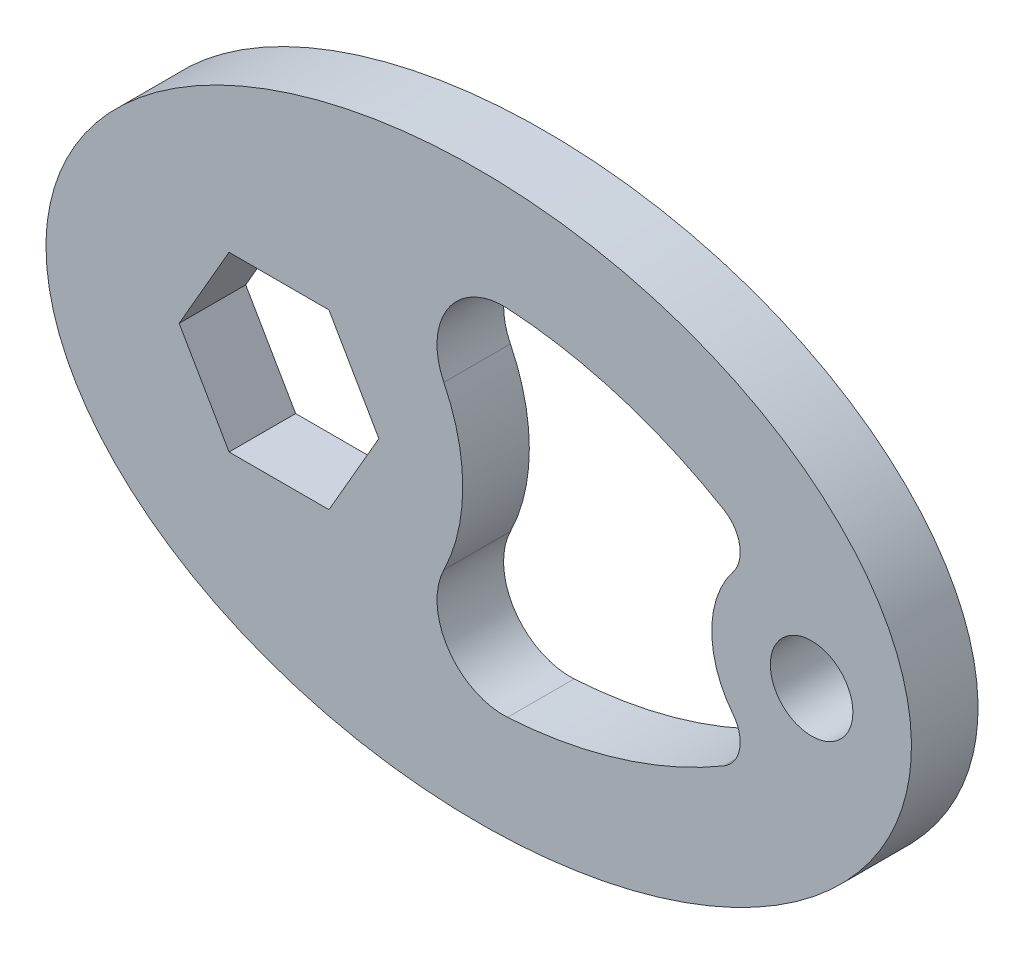
ISO-10303-21;
HEADER;
FILE_DESCRIPTION(('STEP AP214'),'2;1');
FILE_NAME('part.step','',(''),(''),'','','');
FILE_SCHEMA(('AUTOMOTIVE_DESIGN { 1 0 10303 214 1 1 1 1 }'));
ENDSEC;
DATA;
#1=APPLICATION_CONTEXT('core data for automotive mechanical design processes');
#2=APPLICATION_PROTOCOL_DEFINITION('international standard','automotive_design',2000,#1);
#3=PRODUCT_CONTEXT('',#1,'mechanical');
#4=PRODUCT('Part','Part','',(#3));
#5=PRODUCT_RELATED_PRODUCT_CATEGORY('part','',(#4));
#6=PRODUCT_DEFINITION_FORMATION('','',#4);
#7=PRODUCT_DEFINITION_CONTEXT('part definition',#1,'design');
#8=PRODUCT_DEFINITION('design','',#6,#7);
#9=PRODUCT_DEFINITION_SHAPE('','',#8);
#10=(LENGTH_UNIT() NAMED_UNIT(*) SI_UNIT(.MILLI.,.METRE.));
#11=(NAMED_UNIT(*) PLANE_ANGLE_UNIT() SI_UNIT($,.RADIAN.));
#12=(NAMED_UNIT(*) SI_UNIT($,.STERADIAN.) SOLID_ANGLE_UNIT());
#13=UNCERTAINTY_MEASURE_WITH_UNIT(LENGTH_MEASURE(1.E-05),#10,'distance_accuracy_value','');
#14=(GEOMETRIC_REPRESENTATION_CONTEXT(3) GLOBAL_UNCERTAINTY_ASSIGNED_CONTEXT((#13)) GLOBAL_UNIT_ASSIGNED_CONTEXT((#10,
#11,#12)) REPRESENTATION_CONTEXT('',''));
#15=CARTESIAN_POINT('',(0.,0.,0.));
#16=DIRECTION('',(0.,0.,1.));
#17=DIRECTION('',(1.,0.,0.));
#18=AXIS2_PLACEMENT_3D('',#15,#16,#17);
#19=CARTESIAN_POINT('',(0.,0.,0.5));
#20=DIRECTION('',(0.,0.,1.));
#21=DIRECTION('',(1.,0.,0.));
#22=AXIS2_PLACEMENT_3D('',#19,#20,#21);
#23=PLANE('',#22);
#24=CARTESIAN_POINT('',(0.,0.,0.5));
#25=DIRECTION('',(0.,0.,1.));
#26=DIRECTION('',(-1.,0.,0.));
#27=AXIS2_PLACEMENT_3D('',#24,#25,#26);
#28=ELLIPSE('',#27,3.25,2.125);
#29=CARTESIAN_POINT('',(-3.25,0.,0.5));
#30=VERTEX_POINT('',#29);
#31=EDGE_CURVE('E11',#30,#30,#28,.T.);
#32=ORIENTED_EDGE('',*,*,#31,.T.);
#33=EDGE_LOOP('',(#32));
#34=FACE_BOUND('',#33,.T.);
#35=CARTESIAN_POINT('',(2.5,0.,0.5));
#36=DIRECTION('',(0.,0.,1.));
#37=DIRECTION('',(1.,0.,0.));
#38=AXIS2_PLACEMENT_3D('',#35,#36,#37);
#39=CIRCLE('',#38,0.31);
#40=CARTESIAN_POINT('',(2.81,0.,0.5));
#41=VERTEX_POINT('',#40);
#42=EDGE_CURVE('E293',#41,#41,#39,.T.);
#43=ORIENTED_EDGE('',*,*,#42,.F.);
#44=EDGE_LOOP('',(#43));
#45=FACE_BOUND('',#44,.T.);
#46=CARTESIAN_POINT('',(-1.5,0.,0.5));
#47=DIRECTION('',(0.,0.,-1.));
#48=DIRECTION('',(1.,0.,0.));
#49=AXIS2_PLACEMENT_3D('',#46,#47,#48);
#50=CIRCLE('',#49,1.38000000000551);
#51=CARTESIAN_POINT('',(-0.261988234400927,0.60969407759422,0.5));
#52=VERTEX_POINT('',#51);
#53=CARTESIAN_POINT('',(-0.261988234400931,-0.609694077594222,0.5));
#54=VERTEX_POINT('',#53);
#55=EDGE_CURVE('E213',#52,#54,#50,.T.);
#56=ORIENTED_EDGE('',*,*,#55,.F.);
#57=CARTESIAN_POINT('',(0.186566753133179,0.830597728895591,0.5));
#58=DIRECTION('',(0.,0.,1.));
#59=DIRECTION('',(-1.,0.,0.));
#60=AXIS2_PLACEMENT_3D('',#57,#58,#59);
#61=CIRCLE('',#60,0.5);
#62=CARTESIAN_POINT('',(0.21646527126546,1.32970300698178,0.5));
#63=VERTEX_POINT('',#62);
#64=EDGE_CURVE('E210',#63,#52,#61,.T.);
#65=ORIENTED_EDGE('',*,*,#64,.F.);
#66=CARTESIAN_POINT('',(-1.16837962915728E-11,-2.28381920635274,0.5));
#67=DIRECTION('',(0.,0.,1.));
#68=DIRECTION('',(1.,0.,0.));
#69=AXIS2_PLACEMENT_3D('',#66,#67,#68);
#70=CIRCLE('',#69,3.61999999999049);
#71=CARTESIAN_POINT('',(1.84087654485441,0.83316227361999,0.5));
#72=VERTEX_POINT('',#71);
#73=EDGE_CURVE('E233',#72,#63,#70,.T.);
#74=ORIENTED_EDGE('',*,*,#73,.F.);
#75=CARTESIAN_POINT('',(1.71374418678321,0.617901121687606,0.5));
#76=DIRECTION('',(0.,0.,1.));
#77=DIRECTION('',(1.,0.,0.));
#78=AXIS2_PLACEMENT_3D('',#75,#76,#77);
#79=CIRCLE('',#78,0.25);
#80=CARTESIAN_POINT('',(1.91030814008741,0.463425841265707,0.5));
#81=VERTEX_POINT('',#80);
#82=EDGE_CURVE('E229',#81,#72,#79,.T.);
#83=ORIENTED_EDGE('',*,*,#82,.F.);
#84=CARTESIAN_POINT('',(2.5,0.,0.5));
#85=DIRECTION('',(0.,0.,-1.));
#86=DIRECTION('',(1.,0.,0.));
#87=AXIS2_PLACEMENT_3D('',#84,#85,#86);
#88=CIRCLE('',#87,0.750000000000003);
#89=CARTESIAN_POINT('',(1.91030814008741,-0.463425841265711,0.5));
#90=VERTEX_POINT('',#89);
#91=EDGE_CURVE('E226',#90,#81,#88,.T.);
#92=ORIENTED_EDGE('',*,*,#91,.F.);
#93=CARTESIAN_POINT('',(1.71374418678321,-0.617901121687612,0.5));
#94=DIRECTION('',(0.,0.,1.));
#95=DIRECTION('',(-1.,0.,0.));
#96=AXIS2_PLACEMENT_3D('',#93,#94,#95);
#97=CIRCLE('',#96,0.25);
#98=CARTESIAN_POINT('',(1.84087654485441,-0.833162273619997,0.5));
#99=VERTEX_POINT('',#98);
#100=EDGE_CURVE('E223',#99,#90,#97,.T.);
#101=ORIENTED_EDGE('',*,*,#100,.F.);
#102=CARTESIAN_POINT('',(-1.16794594828828E-11,2.28381920635274,0.5));
#103=DIRECTION('',(0.,0.,1.));
#104=DIRECTION('',(-1.,0.,0.));
#105=AXIS2_PLACEMENT_3D('',#102,#103,#104);
#106=CIRCLE('',#105,3.61999999999049);
#107=CARTESIAN_POINT('',(0.216465271265454,-1.32970300698179,0.5));
#108=VERTEX_POINT('',#107);
#109=EDGE_CURVE('E220',#108,#99,#106,.T.);
#110=ORIENTED_EDGE('',*,*,#109,.F.);
#111=CARTESIAN_POINT('',(0.186566753133175,-0.830597728895594,0.5));
#112=DIRECTION('',(0.,0.,1.));
#113=DIRECTION('',(1.,0.,0.));
#114=AXIS2_PLACEMENT_3D('',#111,#112,#113);
#115=CIRCLE('',#114,0.5);
#116=EDGE_CURVE('E217',#54,#108,#115,.T.);
#117=ORIENTED_EDGE('',*,*,#116,.F.);
#118=EDGE_LOOP('',(#56,#65,#74,#83,#92,#101,#110,#117));
#119=FACE_BOUND('',#118,.T.);
#120=DIRECTION('',(-0.5,0.866025403784439,0.));
#121=VECTOR('',#120,1.);
#122=CARTESIAN_POINT('',(-0.75,0.,0.5));
#123=LINE('',#122,#121);
#124=CARTESIAN_POINT('',(-0.75,0.,0.5));
#125=VERTEX_POINT('',#124);
#126=CARTESIAN_POINT('',(-1.125,0.649519052838329,0.5));
#127=VERTEX_POINT('',#126);
#128=EDGE_CURVE('E150',#125,#127,#123,.T.);
#129=ORIENTED_EDGE('',*,*,#128,.F.);
#130=DIRECTION('',(0.5,0.866025403784439,0.));
#131=VECTOR('',#130,1.);
#132=CARTESIAN_POINT('',(-1.125,-0.649519052838329,0.5));
#133=LINE('',#132,#131);
#134=CARTESIAN_POINT('',(-1.125,-0.649519052838329,0.5));
#135=VERTEX_POINT('',#134);
#136=EDGE_CURVE('E141',#135,#125,#133,.T.);
#137=ORIENTED_EDGE('',*,*,#136,.F.);
#138=DIRECTION('',(1.,0.,0.));
#139=VECTOR('',#138,1.);
#140=CARTESIAN_POINT('',(-1.875,-0.649519052838329,0.5));
#141=LINE('',#140,#139);
#142=CARTESIAN_POINT('',(-1.875,-0.649519052838329,0.5));
#143=VERTEX_POINT('',#142);
#144=EDGE_CURVE('E176',#143,#135,#141,.T.);
#145=ORIENTED_EDGE('',*,*,#144,.F.);
#146=DIRECTION('',(0.5,-0.866025403784439,0.));
#147=VECTOR('',#146,1.);
#148=CARTESIAN_POINT('',(-2.25,0.,0.5));
#149=LINE('',#148,#147);
#150=CARTESIAN_POINT('',(-2.25,0.,0.5));
#151=VERTEX_POINT('',#150);
#152=EDGE_CURVE('E173',#151,#143,#149,.T.);
#153=ORIENTED_EDGE('',*,*,#152,.F.);
#154=DIRECTION('',(-0.5,-0.866025403784439,0.));
#155=VECTOR('',#154,1.);
#156=CARTESIAN_POINT('',(-1.875,0.649519052838329,0.5));
#157=LINE('',#156,#155);
#158=CARTESIAN_POINT('',(-1.875,0.649519052838329,0.5));
#159=VERTEX_POINT('',#158);
#160=EDGE_CURVE('E168',#159,#151,#157,.T.);
#161=ORIENTED_EDGE('',*,*,#160,.F.);
#162=DIRECTION('',(-1.,0.,0.));
#163=VECTOR('',#162,1.);
#164=CARTESIAN_POINT('',(-1.125,0.649519052838329,0.5));
#165=LINE('',#164,#163);
#166=EDGE_CURVE('E164',#127,#159,#165,.T.);
#167=ORIENTED_EDGE('',*,*,#166,.F.);
#168=EDGE_LOOP('',(#129,#137,#145,#153,#161,#167));
#169=FACE_BOUND('',#168,.T.);
#170=ADVANCED_FACE('F39',(#34,#45,#119,#169),#23,.T.);
#171=CARTESIAN_POINT('',(0.,0.,0.));
#172=DIRECTION('',(0.,0.,1.));
#173=DIRECTION('',(1.,0.,0.));
#174=AXIS2_PLACEMENT_3D('',#171,#172,#173);
#175=PLANE('',#174);
#176=CARTESIAN_POINT('',(0.186566753133179,0.830597728895591,0.));
#177=DIRECTION('',(0.,0.,1.));
#178=DIRECTION('',(-1.,0.,0.));
#179=AXIS2_PLACEMENT_3D('',#176,#177,#178);
#180=CIRCLE('',#179,0.5);
#181=CARTESIAN_POINT('',(0.21646527126546,1.32970300698178,0.));
#182=VERTEX_POINT('',#181);
#183=CARTESIAN_POINT('',(-0.261988234400927,0.60969407759422,0.));
#184=VERTEX_POINT('',#183);
#185=EDGE_CURVE('E159',#182,#184,#180,.T.);
#186=ORIENTED_EDGE('',*,*,#185,.T.);
#187=CARTESIAN_POINT('',(-1.5,0.,0.));
#188=DIRECTION('',(0.,0.,-1.));
#189=DIRECTION('',(1.,0.,0.));
#190=AXIS2_PLACEMENT_3D('',#187,#188,#189);
#191=CIRCLE('',#190,1.38000000000551);
#192=CARTESIAN_POINT('',(-0.261988234400931,-0.609694077594222,0.));
#193=VERTEX_POINT('',#192);
#194=EDGE_CURVE('E240',#184,#193,#191,.T.);
#195=ORIENTED_EDGE('',*,*,#194,.T.);
#196=CARTESIAN_POINT('',(0.186566753133175,-0.830597728895594,0.));
#197=DIRECTION('',(0.,0.,1.));
#198=DIRECTION('',(1.,0.,0.));
#199=AXIS2_PLACEMENT_3D('',#196,#197,#198);
#200=CIRCLE('',#199,0.5);
#201=CARTESIAN_POINT('',(0.216465271265454,-1.32970300698179,0.));
#202=VERTEX_POINT('',#201);
#203=EDGE_CURVE('E244',#193,#202,#200,.T.);
#204=ORIENTED_EDGE('',*,*,#203,.T.);
#205=CARTESIAN_POINT('',(-1.16794594828828E-11,2.28381920635274,0.));
#206=DIRECTION('',(0.,0.,1.));
#207=DIRECTION('',(-1.,0.,0.));
#208=AXIS2_PLACEMENT_3D('',#205,#206,#207);
#209=CIRCLE('',#208,3.61999999999049);
#210=CARTESIAN_POINT('',(1.84087654485441,-0.833162273619997,0.));
#211=VERTEX_POINT('',#210);
#212=EDGE_CURVE('E248',#202,#211,#209,.T.);
#213=ORIENTED_EDGE('',*,*,#212,.T.);
#214=CARTESIAN_POINT('',(1.71374418678321,-0.617901121687612,0.));
#215=DIRECTION('',(0.,0.,1.));
#216=DIRECTION('',(-1.,0.,0.));
#217=AXIS2_PLACEMENT_3D('',#214,#215,#216);
#218=CIRCLE('',#217,0.25);
#219=CARTESIAN_POINT('',(1.91030814008741,-0.463425841265711,0.));
#220=VERTEX_POINT('',#219);
#221=EDGE_CURVE('E252',#211,#220,#218,.T.);
#222=ORIENTED_EDGE('',*,*,#221,.T.);
#223=CARTESIAN_POINT('',(2.5,0.,0.));
#224=DIRECTION('',(0.,0.,-1.));
#225=DIRECTION('',(1.,0.,0.));
#226=AXIS2_PLACEMENT_3D('',#223,#224,#225);
#227=CIRCLE('',#226,0.750000000000003);
#228=CARTESIAN_POINT('',(1.91030814008741,0.463425841265707,0.));
#229=VERTEX_POINT('',#228);
#230=EDGE_CURVE('E256',#220,#229,#227,.T.);
#231=ORIENTED_EDGE('',*,*,#230,.T.);
#232=CARTESIAN_POINT('',(1.71374418678321,0.617901121687606,0.));
#233=DIRECTION('',(0.,0.,1.));
#234=DIRECTION('',(1.,0.,0.));
#235=AXIS2_PLACEMENT_3D('',#232,#233,#234);
#236=CIRCLE('',#235,0.25);
#237=CARTESIAN_POINT('',(1.84087654485441,0.83316227361999,0.));
#238=VERTEX_POINT('',#237);
#239=EDGE_CURVE('E260',#229,#238,#236,.T.);
#240=ORIENTED_EDGE('',*,*,#239,.T.);
#241=CARTESIAN_POINT('',(-1.16837962915728E-11,-2.28381920635274,0.));
#242=DIRECTION('',(0.,0.,1.));
#243=DIRECTION('',(1.,0.,0.));
#244=AXIS2_PLACEMENT_3D('',#241,#242,#243);
#245=CIRCLE('',#244,3.61999999999049);
#246=EDGE_CURVE('E214',#238,#182,#245,.T.);
#247=ORIENTED_EDGE('',*,*,#246,.T.);
#248=EDGE_LOOP('',(#186,#195,#204,#213,#222,#231,#240,#247));
#249=FACE_BOUND('',#248,.T.);
#250=CARTESIAN_POINT('',(0.,0.,0.));
#251=DIRECTION('',(0.,0.,1.));
#252=DIRECTION('',(-1.,0.,0.));
#253=AXIS2_PLACEMENT_3D('',#250,#251,#252);
#254=ELLIPSE('',#253,3.25,2.125);
#255=CARTESIAN_POINT('',(-3.25,0.,0.));
#256=VERTEX_POINT('',#255);
#257=EDGE_CURVE('E44',#256,#256,#254,.T.);
#258=ORIENTED_EDGE('',*,*,#257,.F.);
#259=EDGE_LOOP('',(#258));
#260=FACE_BOUND('',#259,.T.);
#261=CARTESIAN_POINT('',(2.5,0.,0.));
#262=DIRECTION('',(0.,0.,1.));
#263=DIRECTION('',(1.,0.,0.));
#264=AXIS2_PLACEMENT_3D('',#261,#262,#263);
#265=CIRCLE('',#264,0.31);
#266=CARTESIAN_POINT('',(2.81,0.,0.));
#267=VERTEX_POINT('',#266);
#268=EDGE_CURVE('E292',#267,#267,#265,.T.);
#269=ORIENTED_EDGE('',*,*,#268,.T.);
#270=EDGE_LOOP('',(#269));
#271=FACE_BOUND('',#270,.T.);
#272=DIRECTION('',(0.5,0.866025403784439,0.));
#273=VECTOR('',#272,1.);
#274=CARTESIAN_POINT('',(-1.125,-0.649519052838329,0.));
#275=LINE('',#274,#273);
#276=CARTESIAN_POINT('',(-1.125,-0.649519052838329,0.));
#277=VERTEX_POINT('',#276);
#278=CARTESIAN_POINT('',(-0.75,0.,0.));
#279=VERTEX_POINT('',#278);
#280=EDGE_CURVE('E63',#277,#279,#275,.T.);
#281=ORIENTED_EDGE('',*,*,#280,.T.);
#282=DIRECTION('',(-0.5,0.866025403784439,0.));
#283=VECTOR('',#282,1.);
#284=CARTESIAN_POINT('',(-0.75,0.,0.));
#285=LINE('',#284,#283);
#286=CARTESIAN_POINT('',(-1.125,0.649519052838329,0.));
#287=VERTEX_POINT('',#286);
#288=EDGE_CURVE('E157',#279,#287,#285,.T.);
#289=ORIENTED_EDGE('',*,*,#288,.T.);
#290=DIRECTION('',(-1.,0.,0.));
#291=VECTOR('',#290,1.);
#292=CARTESIAN_POINT('',(-1.125,0.649519052838329,0.));
#293=LINE('',#292,#291);
#294=CARTESIAN_POINT('',(-1.875,0.649519052838329,0.));
#295=VERTEX_POINT('',#294);
#296=EDGE_CURVE('E183',#287,#295,#293,.T.);
#297=ORIENTED_EDGE('',*,*,#296,.T.);
#298=DIRECTION('',(-0.5,-0.866025403784439,0.));
#299=VECTOR('',#298,1.);
#300=CARTESIAN_POINT('',(-1.875,0.649519052838329,0.));
#301=LINE('',#300,#299);
#302=CARTESIAN_POINT('',(-2.25,0.,0.));
#303=VERTEX_POINT('',#302);
#304=EDGE_CURVE('E187',#295,#303,#301,.T.);
#305=ORIENTED_EDGE('',*,*,#304,.T.);
#306=DIRECTION('',(0.5,-0.866025403784439,0.));
#307=VECTOR('',#306,1.);
#308=CARTESIAN_POINT('',(-2.25,0.,0.));
#309=LINE('',#308,#307);
#310=CARTESIAN_POINT('',(-1.875,-0.649519052838329,0.));
#311=VERTEX_POINT('',#310);
#312=EDGE_CURVE('E191',#303,#311,#309,.T.);
#313=ORIENTED_EDGE('',*,*,#312,.T.);
#314=DIRECTION('',(1.,0.,0.));
#315=VECTOR('',#314,1.);
#316=CARTESIAN_POINT('',(-1.875,-0.649519052838329,0.));
#317=LINE('',#316,#315);
#318=EDGE_CURVE('E151',#311,#277,#317,.T.);
#319=ORIENTED_EDGE('',*,*,#318,.T.);
#320=EDGE_LOOP('',(#281,#289,#297,#305,#313,#319));
#321=FACE_BOUND('',#320,.T.);
#322=ADVANCED_FACE('F302',(#249,#260,#271,#321),#175,.F.);
#323=DIRECTION('',(0.,0.,-1.));
#324=VECTOR('',#323,1.);
#325=SURFACE_OF_LINEAR_EXTRUSION('',#28,#324);
#326=ORIENTED_EDGE('',*,*,#31,.F.);
#327=EDGE_LOOP('',(#326));
#328=FACE_BOUND('',#327,.T.);
#329=ORIENTED_EDGE('',*,*,#257,.T.);
#330=EDGE_LOOP('',(#329));
#331=FACE_BOUND('',#330,.T.);
#332=ADVANCED_FACE('F41',(#328,#331),#325,.F.);
#333=CARTESIAN_POINT('',(2.5,0.,0.5));
#334=DIRECTION('',(0.,0.,-1.));
#335=DIRECTION('',(-1.,0.,0.));
#336=AXIS2_PLACEMENT_3D('',#333,#334,#335);
#337=CYLINDRICAL_SURFACE('',#336,0.31);
#338=ORIENTED_EDGE('',*,*,#42,.T.);
#339=EDGE_LOOP('',(#338));
#340=FACE_BOUND('',#339,.T.);
#341=ORIENTED_EDGE('',*,*,#268,.F.);
#342=EDGE_LOOP('',(#341));
#343=FACE_BOUND('',#342,.T.);
#344=ADVANCED_FACE('F305',(#340,#343),#337,.F.);
#345=CARTESIAN_POINT('',(0.186566753133179,0.830597728895591,0.5));
#346=DIRECTION('',(0.,0.,-1.));
#347=DIRECTION('',(-1.,0.,0.));
#348=AXIS2_PLACEMENT_3D('',#345,#346,#347);
#349=CYLINDRICAL_SURFACE('',#348,0.5);
#350=ORIENTED_EDGE('',*,*,#185,.F.);
#351=DIRECTION('',(0.,0.,-1.));
#352=VECTOR('',#351,1.);
#353=CARTESIAN_POINT('',(0.21646527126546,1.32970300698178,0.5));
#354=LINE('',#353,#352);
#355=EDGE_CURVE('E236',#63,#182,#354,.T.);
#356=ORIENTED_EDGE('',*,*,#355,.F.);
#357=ORIENTED_EDGE('',*,*,#64,.T.);
#358=DIRECTION('',(0.,0.,-1.));
#359=VECTOR('',#358,1.);
#360=CARTESIAN_POINT('',(-0.261988234400927,0.60969407759422,0.5));
#361=LINE('',#360,#359);
#362=EDGE_CURVE('E288',#52,#184,#361,.T.);
#363=ORIENTED_EDGE('',*,*,#362,.T.);
#364=EDGE_LOOP('',(#350,#356,#357,#363));
#365=FACE_BOUND('',#364,.T.);
#366=ADVANCED_FACE('F307',(#365),#349,.F.);
#367=CARTESIAN_POINT('',(-1.5,0.,0.5));
#368=DIRECTION('',(0.,0.,-1.));
#369=DIRECTION('',(-1.,0.,0.));
#370=AXIS2_PLACEMENT_3D('',#367,#368,#369);
#371=CYLINDRICAL_SURFACE('',#370,1.38000000000551);
#372=ORIENTED_EDGE('',*,*,#194,.F.);
#373=ORIENTED_EDGE('',*,*,#362,.F.);
#374=ORIENTED_EDGE('',*,*,#55,.T.);
#375=DIRECTION('',(0.,0.,-1.));
#376=VECTOR('',#375,1.);
#377=CARTESIAN_POINT('',(-0.261988234400931,-0.609694077594222,0.5));
#378=LINE('',#377,#376);
#379=EDGE_CURVE('E285',#54,#193,#378,.T.);
#380=ORIENTED_EDGE('',*,*,#379,.T.);
#381=EDGE_LOOP('',(#372,#373,#374,#380));
#382=FACE_BOUND('',#381,.T.);
#383=ADVANCED_FACE('F314',(#382),#371,.T.);
#384=CARTESIAN_POINT('',(0.186566753133175,-0.830597728895594,0.5));
#385=DIRECTION('',(0.,0.,-1.));
#386=DIRECTION('',(-1.,0.,0.));
#387=AXIS2_PLACEMENT_3D('',#384,#385,#386);
#388=CYLINDRICAL_SURFACE('',#387,0.5);
#389=ORIENTED_EDGE('',*,*,#203,.F.);
#390=ORIENTED_EDGE('',*,*,#379,.F.);
#391=ORIENTED_EDGE('',*,*,#116,.T.);
#392=DIRECTION('',(0.,0.,-1.));
#393=VECTOR('',#392,1.);
#394=CARTESIAN_POINT('',(0.216465271265454,-1.32970300698179,0.5));
#395=LINE('',#394,#393);
#396=EDGE_CURVE('E282',#108,#202,#395,.T.);
#397=ORIENTED_EDGE('',*,*,#396,.T.);
#398=EDGE_LOOP('',(#389,#390,#391,#397));
#399=FACE_BOUND('',#398,.T.);
#400=ADVANCED_FACE('F339',(#399),#388,.F.);
#401=CARTESIAN_POINT('',(-1.16794594828828E-11,2.28381920635274,0.5));
#402=DIRECTION('',(0.,0.,-1.));
#403=DIRECTION('',(-1.,0.,0.));
#404=AXIS2_PLACEMENT_3D('',#401,#402,#403);
#405=CYLINDRICAL_SURFACE('',#404,3.61999999999049);
#406=ORIENTED_EDGE('',*,*,#212,.F.);
#407=ORIENTED_EDGE('',*,*,#396,.F.);
#408=ORIENTED_EDGE('',*,*,#109,.T.);
#409=DIRECTION('',(0.,0.,-1.));
#410=VECTOR('',#409,1.);
#411=CARTESIAN_POINT('',(1.84087654485441,-0.833162273619997,0.5));
#412=LINE('',#411,#410);
#413=EDGE_CURVE('E279',#99,#211,#412,.T.);
#414=ORIENTED_EDGE('',*,*,#413,.T.);
#415=EDGE_LOOP('',(#406,#407,#408,#414));
#416=FACE_BOUND('',#415,.T.);
#417=ADVANCED_FACE('F363',(#416),#405,.F.);
#418=CARTESIAN_POINT('',(1.71374418678321,-0.617901121687612,0.5));
#419=DIRECTION('',(0.,0.,-1.));
#420=DIRECTION('',(-1.,0.,0.));
#421=AXIS2_PLACEMENT_3D('',#418,#419,#420);
#422=CYLINDRICAL_SURFACE('',#421,0.25);
#423=ORIENTED_EDGE('',*,*,#221,.F.);
#424=ORIENTED_EDGE('',*,*,#413,.F.);
#425=ORIENTED_EDGE('',*,*,#100,.T.);
#426=DIRECTION('',(0.,0.,-1.));
#427=VECTOR('',#426,1.);
#428=CARTESIAN_POINT('',(1.91030814008741,-0.463425841265711,0.5));
#429=LINE('',#428,#427);
#430=EDGE_CURVE('E276',#90,#220,#429,.T.);
#431=ORIENTED_EDGE('',*,*,#430,.T.);
#432=EDGE_LOOP('',(#423,#424,#425,#431));
#433=FACE_BOUND('',#432,.T.);
#434=ADVANCED_FACE('F360',(#433),#422,.F.);
#435=CARTESIAN_POINT('',(2.5,0.,0.5));
#436=DIRECTION('',(0.,0.,-1.));
#437=DIRECTION('',(-1.,0.,0.));
#438=AXIS2_PLACEMENT_3D('',#435,#436,#437);
#439=CYLINDRICAL_SURFACE('',#438,0.750000000000003);
#440=ORIENTED_EDGE('',*,*,#230,.F.);
#441=ORIENTED_EDGE('',*,*,#430,.F.);
#442=ORIENTED_EDGE('',*,*,#91,.T.);
#443=DIRECTION('',(0.,0.,-1.));
#444=VECTOR('',#443,1.);
#445=CARTESIAN_POINT('',(1.91030814008741,0.463425841265707,0.5));
#446=LINE('',#445,#444);
#447=EDGE_CURVE('E273',#81,#229,#446,.T.);
#448=ORIENTED_EDGE('',*,*,#447,.T.);
#449=EDGE_LOOP('',(#440,#441,#442,#448));
#450=FACE_BOUND('',#449,.T.);
#451=ADVANCED_FACE('F357',(#450),#439,.T.);
#452=CARTESIAN_POINT('',(1.71374418678321,0.617901121687606,0.5));
#453=DIRECTION('',(0.,0.,-1.));
#454=DIRECTION('',(-1.,0.,0.));
#455=AXIS2_PLACEMENT_3D('',#452,#453,#454);
#456=CYLINDRICAL_SURFACE('',#455,0.25);
#457=ORIENTED_EDGE('',*,*,#239,.F.);
#458=ORIENTED_EDGE('',*,*,#447,.F.);
#459=ORIENTED_EDGE('',*,*,#82,.T.);
#460=DIRECTION('',(0.,0.,-1.));
#461=VECTOR('',#460,1.);
#462=CARTESIAN_POINT('',(1.84087654485441,0.83316227361999,0.5));
#463=LINE('',#462,#461);
#464=EDGE_CURVE('E270',#72,#238,#463,.T.);
#465=ORIENTED_EDGE('',*,*,#464,.T.);
#466=EDGE_LOOP('',(#457,#458,#459,#465));
#467=FACE_BOUND('',#466,.T.);
#468=ADVANCED_FACE('F351',(#467),#456,.F.);
#469=CARTESIAN_POINT('',(-1.16837962915728E-11,-2.28381920635274,0.5));
#470=DIRECTION('',(0.,0.,-1.));
#471=DIRECTION('',(-1.,0.,0.));
#472=AXIS2_PLACEMENT_3D('',#469,#470,#471);
#473=CYLINDRICAL_SURFACE('',#472,3.61999999999049);
#474=ORIENTED_EDGE('',*,*,#246,.F.);
#475=ORIENTED_EDGE('',*,*,#464,.F.);
#476=ORIENTED_EDGE('',*,*,#73,.T.);
#477=ORIENTED_EDGE('',*,*,#355,.T.);
#478=EDGE_LOOP('',(#474,#475,#476,#477));
#479=FACE_BOUND('',#478,.T.);
#480=ADVANCED_FACE('F346',(#479),#473,.F.);
#481=CARTESIAN_POINT('',(-1.125,-0.649519052838329,0.5));
#482=DIRECTION('',(-0.866025403784439,0.5,0.));
#483=DIRECTION('',(-0.5,-0.866025403784439,0.));
#484=AXIS2_PLACEMENT_3D('',#481,#482,#483);
#485=PLANE('',#484);
#486=ORIENTED_EDGE('',*,*,#280,.F.);
#487=DIRECTION('',(0.,0.,-1.));
#488=VECTOR('',#487,1.);
#489=CARTESIAN_POINT('',(-1.125,-0.649519052838329,0.5));
#490=LINE('',#489,#488);
#491=EDGE_CURVE('E145',#135,#277,#490,.T.);
#492=ORIENTED_EDGE('',*,*,#491,.F.);
#493=ORIENTED_EDGE('',*,*,#136,.T.);
#494=DIRECTION('',(0.,0.,-1.));
#495=VECTOR('',#494,1.);
#496=CARTESIAN_POINT('',(-0.75,0.,0.5));
#497=LINE('',#496,#495);
#498=EDGE_CURVE('E144',#125,#279,#497,.T.);
#499=ORIENTED_EDGE('',*,*,#498,.T.);
#500=EDGE_LOOP('',(#486,#492,#493,#499));
#501=FACE_BOUND('',#500,.T.);
#502=ADVANCED_FACE('F143',(#501),#485,.T.);
#503=CARTESIAN_POINT('',(-0.75,0.,0.5));
#504=DIRECTION('',(-0.866025403784439,-0.5,0.));
#505=DIRECTION('',(0.5,-0.866025403784439,0.));
#506=AXIS2_PLACEMENT_3D('',#503,#504,#505);
#507=PLANE('',#506);
#508=ORIENTED_EDGE('',*,*,#288,.F.);
#509=ORIENTED_EDGE('',*,*,#498,.F.);
#510=ORIENTED_EDGE('',*,*,#128,.T.);
#511=DIRECTION('',(0.,0.,-1.));
#512=VECTOR('',#511,1.);
#513=CARTESIAN_POINT('',(-1.125,0.649519052838329,0.5));
#514=LINE('',#513,#512);
#515=EDGE_CURVE('E160',#127,#287,#514,.T.);
#516=ORIENTED_EDGE('',*,*,#515,.T.);
#517=EDGE_LOOP('',(#508,#509,#510,#516));
#518=FACE_BOUND('',#517,.T.);
#519=ADVANCED_FACE('F154',(#518),#507,.T.);
#520=CARTESIAN_POINT('',(-1.125,0.649519052838329,0.5));
#521=DIRECTION('',(0.,-1.,0.));
#522=DIRECTION('',(1.,0.,0.));
#523=AXIS2_PLACEMENT_3D('',#520,#521,#522);
#524=PLANE('',#523);
#525=ORIENTED_EDGE('',*,*,#296,.F.);
#526=ORIENTED_EDGE('',*,*,#515,.F.);
#527=ORIENTED_EDGE('',*,*,#166,.T.);
#528=DIRECTION('',(0.,0.,-1.));
#529=VECTOR('',#528,1.);
#530=CARTESIAN_POINT('',(-1.875,0.649519052838329,0.5));
#531=LINE('',#530,#529);
#532=EDGE_CURVE('E205',#159,#295,#531,.T.);
#533=ORIENTED_EDGE('',*,*,#532,.T.);
#534=EDGE_LOOP('',(#525,#526,#527,#533));
#535=FACE_BOUND('',#534,.T.);
#536=ADVANCED_FACE('F433',(#535),#524,.T.);
#537=CARTESIAN_POINT('',(-1.875,0.649519052838329,0.5));
#538=DIRECTION('',(0.866025403784439,-0.5,0.));
#539=DIRECTION('',(0.5,0.866025403784439,0.));
#540=AXIS2_PLACEMENT_3D('',#537,#538,#539);
#541=PLANE('',#540);
#542=ORIENTED_EDGE('',*,*,#304,.F.);
#543=ORIENTED_EDGE('',*,*,#532,.F.);
#544=ORIENTED_EDGE('',*,*,#160,.T.);
#545=DIRECTION('',(0.,0.,-1.));
#546=VECTOR('',#545,1.);
#547=CARTESIAN_POINT('',(-2.25,0.,0.5));
#548=LINE('',#547,#546);
#549=EDGE_CURVE('E202',#151,#303,#548,.T.);
#550=ORIENTED_EDGE('',*,*,#549,.T.);
#551=EDGE_LOOP('',(#542,#543,#544,#550));
#552=FACE_BOUND('',#551,.T.);
#553=ADVANCED_FACE('F442',(#552),#541,.T.);
#554=CARTESIAN_POINT('',(-2.25,0.,0.5));
#555=DIRECTION('',(0.866025403784439,0.5,0.));
#556=DIRECTION('',(-0.5,0.866025403784439,0.));
#557=AXIS2_PLACEMENT_3D('',#554,#555,#556);
#558=PLANE('',#557);
#559=ORIENTED_EDGE('',*,*,#312,.F.);
#560=ORIENTED_EDGE('',*,*,#549,.F.);
#561=ORIENTED_EDGE('',*,*,#152,.T.);
#562=DIRECTION('',(0.,0.,-1.));
#563=VECTOR('',#562,1.);
#564=CARTESIAN_POINT('',(-1.875,-0.649519052838329,0.5));
#565=LINE('',#564,#563);
#566=EDGE_CURVE('E55',#143,#311,#565,.T.);
#567=ORIENTED_EDGE('',*,*,#566,.T.);
#568=EDGE_LOOP('',(#559,#560,#561,#567));
#569=FACE_BOUND('',#568,.T.);
#570=ADVANCED_FACE('F452',(#569),#558,.T.);
#571=CARTESIAN_POINT('',(-1.875,-0.649519052838329,0.5));
#572=DIRECTION('',(0.,1.,0.));
#573=DIRECTION('',(-1.,0.,0.));
#574=AXIS2_PLACEMENT_3D('',#571,#572,#573);
#575=PLANE('',#574);
#576=ORIENTED_EDGE('',*,*,#318,.F.);
#577=ORIENTED_EDGE('',*,*,#566,.F.);
#578=ORIENTED_EDGE('',*,*,#144,.T.);
#579=ORIENTED_EDGE('',*,*,#491,.T.);
#580=EDGE_LOOP('',(#576,#577,#578,#579));
#581=FACE_BOUND('',#580,.T.);
#582=ADVANCED_FACE('F462',(#581),#575,.T.);
#583=CLOSED_SHELL('',(#170,#322,#332,#344,#366,#383,#400,#417,#434,#451,#468,#480,#502,#519,
#536,#553,#570,#582));
#584=MANIFOLD_SOLID_BREP('B2',#583);
#585=ADVANCED_BREP_SHAPE_REPRESENTATION('',(#18,#584),#14);
#586=SHAPE_DEFINITION_REPRESENTATION(#9,#585);
ENDSEC;
END-ISO-10303-21;
